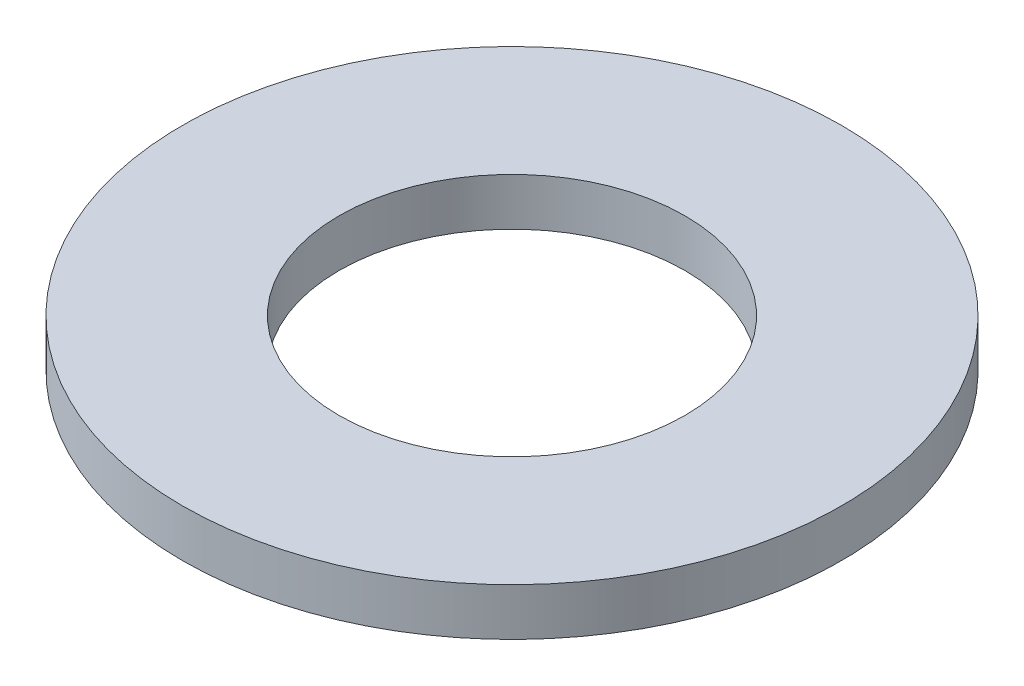
ISO-10303-21;
HEADER;
FILE_DESCRIPTION(('STEP AP214'),'2;1');
FILE_NAME('part.step','',(''),(''),'','','');
FILE_SCHEMA(('AUTOMOTIVE_DESIGN { 1 0 10303 214 1 1 1 1 }'));
ENDSEC;
DATA;
#1=APPLICATION_CONTEXT('core data for automotive mechanical design processes');
#2=APPLICATION_PROTOCOL_DEFINITION('international standard','automotive_design',2000,#1);
#3=PRODUCT_CONTEXT('',#1,'mechanical');
#4=PRODUCT('Part','Part','',(#3));
#5=PRODUCT_RELATED_PRODUCT_CATEGORY('part','',(#4));
#6=PRODUCT_DEFINITION_FORMATION('','',#4);
#7=PRODUCT_DEFINITION_CONTEXT('part definition',#1,'design');
#8=PRODUCT_DEFINITION('design','',#6,#7);
#9=PRODUCT_DEFINITION_SHAPE('','',#8);
#10=(LENGTH_UNIT() NAMED_UNIT(*) SI_UNIT(.MILLI.,.METRE.));
#11=(NAMED_UNIT(*) PLANE_ANGLE_UNIT() SI_UNIT($,.RADIAN.));
#12=(NAMED_UNIT(*) SI_UNIT($,.STERADIAN.) SOLID_ANGLE_UNIT());
#13=UNCERTAINTY_MEASURE_WITH_UNIT(LENGTH_MEASURE(1.E-05),#10,'distance_accuracy_value','');
#14=(GEOMETRIC_REPRESENTATION_CONTEXT(3) GLOBAL_UNCERTAINTY_ASSIGNED_CONTEXT((#13)) GLOBAL_UNIT_ASSIGNED_CONTEXT((#10,
#11,#12)) REPRESENTATION_CONTEXT('',''));
#15=CARTESIAN_POINT('',(0.,0.,0.));
#16=DIRECTION('',(0.,0.,1.));
#17=DIRECTION('',(1.,0.,0.));
#18=AXIS2_PLACEMENT_3D('',#15,#16,#17);
#19=CARTESIAN_POINT('',(0.,0.,0.));
#20=DIRECTION('',(0.,1.,0.));
#21=DIRECTION('',(0.,0.,1.));
#22=AXIS2_PLACEMENT_3D('',#19,#20,#21);
#23=CYLINDRICAL_SURFACE('',#22,8.3312);
#24=CARTESIAN_POINT('',(0.,2.286,0.));
#25=DIRECTION('',(0.,1.,0.));
#26=DIRECTION('',(0.,0.,1.));
#27=AXIS2_PLACEMENT_3D('',#24,#25,#26);
#28=CIRCLE('',#27,8.3312);
#29=CARTESIAN_POINT('',(0.,2.286,8.3312));
#30=VERTEX_POINT('',#29);
#31=EDGE_CURVE('E10',#30,#30,#28,.T.);
#32=ORIENTED_EDGE('',*,*,#31,.T.);
#33=EDGE_LOOP('',(#32));
#34=FACE_BOUND('',#33,.T.);
#35=CARTESIAN_POINT('',(0.,0.,0.));
#36=DIRECTION('',(0.,1.,0.));
#37=DIRECTION('',(0.,0.,1.));
#38=AXIS2_PLACEMENT_3D('',#35,#36,#37);
#39=CIRCLE('',#38,8.3312);
#40=CARTESIAN_POINT('',(0.,0.,8.3312));
#41=VERTEX_POINT('',#40);
#42=EDGE_CURVE('E44',#41,#41,#39,.T.);
#43=ORIENTED_EDGE('',*,*,#42,.F.);
#44=EDGE_LOOP('',(#43));
#45=FACE_BOUND('',#44,.T.);
#46=ADVANCED_FACE('F30',(#34,#45),#23,.F.);
#47=CARTESIAN_POINT('',(8.3312,2.286,0.));
#48=DIRECTION('',(0.,1.,0.));
#49=DIRECTION('',(0.,0.,1.));
#50=AXIS2_PLACEMENT_3D('',#47,#48,#49);
#51=PLANE('',#50);
#52=CARTESIAN_POINT('',(0.,2.286,0.));
#53=DIRECTION('',(0.,1.,0.));
#54=DIRECTION('',(0.,0.,1.));
#55=AXIS2_PLACEMENT_3D('',#52,#53,#54);
#56=CIRCLE('',#55,15.875);
#57=CARTESIAN_POINT('',(0.,2.286,15.875));
#58=VERTEX_POINT('',#57);
#59=EDGE_CURVE('E36',#58,#58,#56,.T.);
#60=ORIENTED_EDGE('',*,*,#59,.T.);
#61=EDGE_LOOP('',(#60));
#62=FACE_BOUND('',#61,.T.);
#63=ORIENTED_EDGE('',*,*,#31,.F.);
#64=EDGE_LOOP('',(#63));
#65=FACE_BOUND('',#64,.T.);
#66=ADVANCED_FACE('F54',(#62,#65),#51,.T.);
#67=CARTESIAN_POINT('',(0.,0.,0.));
#68=DIRECTION('',(0.,1.,0.));
#69=DIRECTION('',(0.,0.,1.));
#70=AXIS2_PLACEMENT_3D('',#67,#68,#69);
#71=CYLINDRICAL_SURFACE('',#70,15.875);
#72=CARTESIAN_POINT('',(0.,0.,0.));
#73=DIRECTION('',(0.,1.,0.));
#74=DIRECTION('',(0.,0.,1.));
#75=AXIS2_PLACEMENT_3D('',#72,#73,#74);
#76=CIRCLE('',#75,15.875);
#77=CARTESIAN_POINT('',(0.,0.,15.875));
#78=VERTEX_POINT('',#77);
#79=EDGE_CURVE('E40',#78,#78,#76,.T.);
#80=ORIENTED_EDGE('',*,*,#79,.T.);
#81=EDGE_LOOP('',(#80));
#82=FACE_BOUND('',#81,.T.);
#83=ORIENTED_EDGE('',*,*,#59,.F.);
#84=EDGE_LOOP('',(#83));
#85=FACE_BOUND('',#84,.T.);
#86=ADVANCED_FACE('F58',(#82,#85),#71,.T.);
#87=CARTESIAN_POINT('',(15.875,0.,0.));
#88=DIRECTION('',(0.,-1.,0.));
#89=DIRECTION('',(0.,0.,-1.));
#90=AXIS2_PLACEMENT_3D('',#87,#88,#89);
#91=PLANE('',#90);
#92=ORIENTED_EDGE('',*,*,#42,.T.);
#93=EDGE_LOOP('',(#92));
#94=FACE_BOUND('',#93,.T.);
#95=ORIENTED_EDGE('',*,*,#79,.F.);
#96=EDGE_LOOP('',(#95));
#97=FACE_BOUND('',#96,.T.);
#98=ADVANCED_FACE('F50',(#94,#97),#91,.T.);
#99=CLOSED_SHELL('',(#46,#66,#86,#98));
#100=MANIFOLD_SOLID_BREP('B2',#99);
#101=ADVANCED_BREP_SHAPE_REPRESENTATION('',(#18,#100),#14);
#102=SHAPE_DEFINITION_REPRESENTATION(#9,#101);
ENDSEC;
END-ISO-10303-21;
